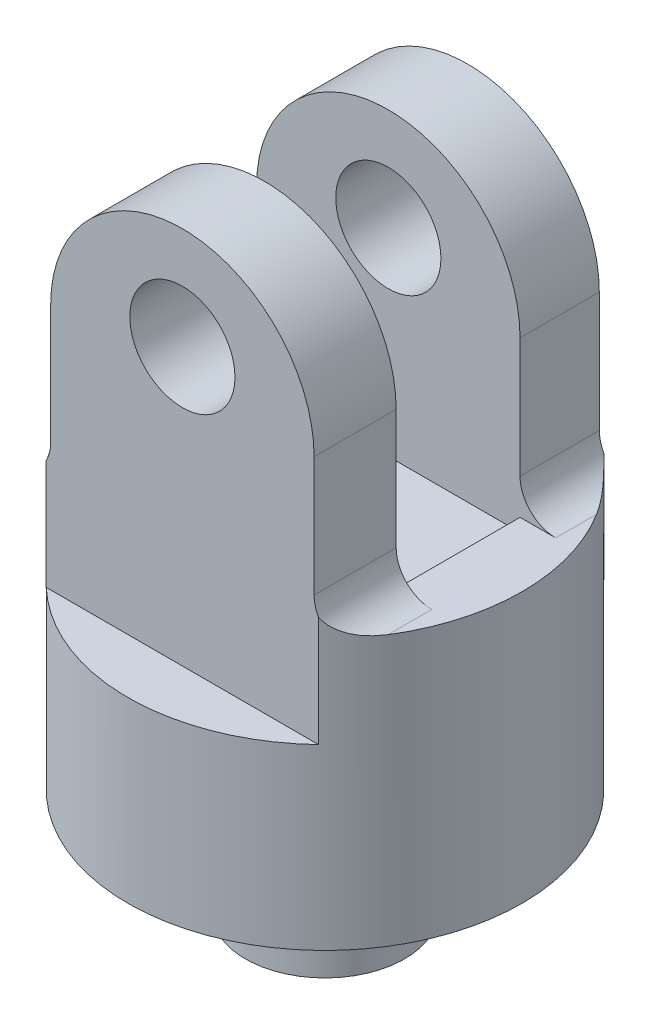
ISO-10303-21;
HEADER;
FILE_DESCRIPTION(('STEP AP214'),'2;1');
FILE_NAME('part.step','',(''),(''),'','','');
FILE_SCHEMA(('AUTOMOTIVE_DESIGN { 1 0 10303 214 1 1 1 1 }'));
ENDSEC;
DATA;
#1=APPLICATION_CONTEXT('core data for automotive mechanical design processes');
#2=APPLICATION_PROTOCOL_DEFINITION('international standard','automotive_design',2000,#1);
#3=PRODUCT_CONTEXT('',#1,'mechanical');
#4=PRODUCT('Part','Part','',(#3));
#5=PRODUCT_RELATED_PRODUCT_CATEGORY('part','',(#4));
#6=PRODUCT_DEFINITION_FORMATION('','',#4);
#7=PRODUCT_DEFINITION_CONTEXT('part definition',#1,'design');
#8=PRODUCT_DEFINITION('design','',#6,#7);
#9=PRODUCT_DEFINITION_SHAPE('','',#8);
#10=(LENGTH_UNIT() NAMED_UNIT(*) SI_UNIT(.MILLI.,.METRE.));
#11=(NAMED_UNIT(*) PLANE_ANGLE_UNIT() SI_UNIT($,.RADIAN.));
#12=(NAMED_UNIT(*) SI_UNIT($,.STERADIAN.) SOLID_ANGLE_UNIT());
#13=UNCERTAINTY_MEASURE_WITH_UNIT(LENGTH_MEASURE(1.E-05),#10,'distance_accuracy_value','');
#14=(GEOMETRIC_REPRESENTATION_CONTEXT(3) GLOBAL_UNCERTAINTY_ASSIGNED_CONTEXT((#13)) GLOBAL_UNIT_ASSIGNED_CONTEXT((#10,
#11,#12)) REPRESENTATION_CONTEXT('',''));
#15=CARTESIAN_POINT('',(0.,0.,0.));
#16=DIRECTION('',(0.,0.,1.));
#17=DIRECTION('',(1.,0.,0.));
#18=AXIS2_PLACEMENT_3D('',#15,#16,#17);
#19=CARTESIAN_POINT('',(-35.3357260875996,3.67124426884152,-80.));
#20=DIRECTION('',(-1.,0.,0.));
#21=DIRECTION('',(0.,0.,1.));
#22=AXIS2_PLACEMENT_3D('',#19,#20,#21);
#23=PLANE('',#22);
#24=DIRECTION('',(0.,-1.,0.));
#25=VECTOR('',#24,1.);
#26=CARTESIAN_POINT('',(-35.3357260875996,110.,-23.0221834509995));
#27=LINE('',#26,#25);
#28=CARTESIAN_POINT('',(-35.3357260875996,47.2672699613345,-23.0221834509995));
#29=VERTEX_POINT('',#28);
#30=CARTESIAN_POINT('',(-35.3357260875996,13.6712442688415,-23.0221834509995));
#31=VERTEX_POINT('',#30);
#32=EDGE_CURVE('E182',#29,#31,#27,.T.);
#33=ORIENTED_EDGE('',*,*,#32,.T.);
#34=DIRECTION('',(0.,0.,1.));
#35=VECTOR('',#34,1.);
#36=CARTESIAN_POINT('',(-35.3357260875996,13.6712442688415,0.));
#37=LINE('',#36,#35);
#38=CARTESIAN_POINT('',(-35.3357260875996,13.6712442688415,0.));
#39=VERTEX_POINT('',#38);
#40=EDGE_CURVE('E318',#31,#39,#37,.T.);
#41=ORIENTED_EDGE('',*,*,#40,.T.);
#42=DIRECTION('',(0.,-1.,0.));
#43=VECTOR('',#42,1.);
#44=CARTESIAN_POINT('',(-35.3357260875996,3.67124426884152,0.));
#45=LINE('',#44,#43);
#46=CARTESIAN_POINT('',(-35.3357260875996,47.2672699613345,0.));
#47=VERTEX_POINT('',#46);
#48=EDGE_CURVE('E261',#47,#39,#45,.T.);
#49=ORIENTED_EDGE('',*,*,#48,.F.);
#50=DIRECTION('',(0.,0.,1.));
#51=VECTOR('',#50,1.);
#52=CARTESIAN_POINT('',(-35.3357260875996,47.2672699613345,-80.));
#53=LINE('',#52,#51);
#54=EDGE_CURVE('E281',#29,#47,#53,.T.);
#55=ORIENTED_EDGE('',*,*,#54,.F.);
#56=EDGE_LOOP('',(#33,#41,#49,#55));
#57=FACE_BOUND('',#56,.T.);
#58=ADVANCED_FACE('F35',(#57),#23,.T.);
#59=DIRECTION('',(0.,-1.,0.));
#60=VECTOR('',#59,1.);
#61=CARTESIAN_POINT('',(-35.3357260875996,3.67124426884152,-80.));
#62=LINE('',#61,#60);
#63=CARTESIAN_POINT('',(-35.3357260875996,47.2672699613345,-80.));
#64=VERTEX_POINT('',#63);
#65=CARTESIAN_POINT('',(-35.3357260875996,13.6712442688415,-80.));
#66=VERTEX_POINT('',#65);
#67=EDGE_CURVE('E266',#64,#66,#62,.T.);
#68=ORIENTED_EDGE('',*,*,#67,.T.);
#69=DIRECTION('',(0.,0.,1.));
#70=VECTOR('',#69,1.);
#71=CARTESIAN_POINT('',(-35.3357260875996,13.6712442688415,-57.7614080820315));
#72=LINE('',#71,#70);
#73=CARTESIAN_POINT('',(-35.3357260875996,13.6712442688415,-57.7614080820315));
#74=VERTEX_POINT('',#73);
#75=EDGE_CURVE('E288',#66,#74,#72,.T.);
#76=ORIENTED_EDGE('',*,*,#75,.T.);
#77=DIRECTION('',(0.,-1.,0.));
#78=VECTOR('',#77,1.);
#79=CARTESIAN_POINT('',(-35.3357260875996,110.,-57.7614080820315));
#80=LINE('',#79,#78);
#81=CARTESIAN_POINT('',(-35.3357260875996,47.2672699613345,-57.7614080820315));
#82=VERTEX_POINT('',#81);
#83=EDGE_CURVE('E210',#82,#74,#80,.T.);
#84=ORIENTED_EDGE('',*,*,#83,.F.);
#85=EDGE_CURVE('E243',#64,#82,#53,.T.);
#86=ORIENTED_EDGE('',*,*,#85,.F.);
#87=EDGE_LOOP('',(#68,#76,#84,#86));
#88=FACE_BOUND('',#87,.T.);
#89=ADVANCED_FACE('F443',(#88),#23,.T.);
#90=CARTESIAN_POINT('',(1.60616936761816,47.2672699613345,-80.));
#91=DIRECTION('',(0.,0.,1.));
#92=DIRECTION('',(1.,0.,0.));
#93=AXIS2_PLACEMENT_3D('',#90,#91,#92);
#94=CYLINDRICAL_SURFACE('',#93,36.9418954552177);
#95=DIRECTION('',(0.,0.,1.));
#96=VECTOR('',#95,1.);
#97=CARTESIAN_POINT('',(38.5480648228359,47.2672699613345,-80.));
#98=LINE('',#97,#96);
#99=CARTESIAN_POINT('',(38.5480648228359,47.2672699613345,-23.0221834509995));
#100=VERTEX_POINT('',#99);
#101=CARTESIAN_POINT('',(38.5480648228359,47.2672699613345,0.));
#102=VERTEX_POINT('',#101);
#103=EDGE_CURVE('E285',#100,#102,#98,.T.);
#104=ORIENTED_EDGE('',*,*,#103,.F.);
#105=CARTESIAN_POINT('',(1.60616936761816,47.2672699613345,-23.0221834509995));
#106=DIRECTION('',(0.,0.,-1.));
#107=DIRECTION('',(-1.,0.,0.));
#108=AXIS2_PLACEMENT_3D('',#105,#106,#107);
#109=CIRCLE('',#108,36.9418954552177);
#110=EDGE_CURVE('E220',#100,#29,#109,.F.);
#111=ORIENTED_EDGE('',*,*,#110,.T.);
#112=ORIENTED_EDGE('',*,*,#54,.T.);
#113=CARTESIAN_POINT('',(1.60616936761816,47.2672699613345,0.));
#114=DIRECTION('',(0.,0.,1.));
#115=DIRECTION('',(-1.,0.,0.));
#116=AXIS2_PLACEMENT_3D('',#113,#114,#115);
#117=CIRCLE('',#116,36.9418954552177);
#118=EDGE_CURVE('E274',#102,#47,#117,.T.);
#119=ORIENTED_EDGE('',*,*,#118,.F.);
#120=EDGE_LOOP('',(#104,#111,#112,#119));
#121=FACE_BOUND('',#120,.T.);
#122=ADVANCED_FACE('F395',(#121),#94,.T.);
#123=ORIENTED_EDGE('',*,*,#85,.T.);
#124=CARTESIAN_POINT('',(1.60616936761816,47.2672699613345,-57.7614080820315));
#125=DIRECTION('',(0.,0.,1.));
#126=DIRECTION('',(1.,0.,0.));
#127=AXIS2_PLACEMENT_3D('',#124,#125,#126);
#128=CIRCLE('',#127,36.9418954552177);
#129=CARTESIAN_POINT('',(38.5480648228359,47.2672699613345,-57.7614080820315));
#130=VERTEX_POINT('',#129);
#131=EDGE_CURVE('E215',#82,#130,#128,.F.);
#132=ORIENTED_EDGE('',*,*,#131,.T.);
#133=CARTESIAN_POINT('',(38.5480648228359,47.2672699613345,-80.));
#134=VERTEX_POINT('',#133);
#135=EDGE_CURVE('E282',#134,#130,#98,.T.);
#136=ORIENTED_EDGE('',*,*,#135,.F.);
#137=CARTESIAN_POINT('',(1.60616936761816,47.2672699613345,-80.));
#138=DIRECTION('',(0.,0.,1.));
#139=DIRECTION('',(-1.,0.,0.));
#140=AXIS2_PLACEMENT_3D('',#137,#138,#139);
#141=CIRCLE('',#140,36.9418954552177);
#142=EDGE_CURVE('E263',#134,#64,#141,.T.);
#143=ORIENTED_EDGE('',*,*,#142,.T.);
#144=EDGE_LOOP('',(#123,#132,#136,#143));
#145=FACE_BOUND('',#144,.T.);
#146=ADVANCED_FACE('F452',(#145),#94,.T.);
#147=CARTESIAN_POINT('',(38.5480648228359,3.67124426884152,-80.));
#148=DIRECTION('',(1.,0.,0.));
#149=DIRECTION('',(0.,0.,-1.));
#150=AXIS2_PLACEMENT_3D('',#147,#148,#149);
#151=PLANE('',#150);
#152=DIRECTION('',(0.,1.,0.));
#153=VECTOR('',#152,1.);
#154=CARTESIAN_POINT('',(38.5480648228359,3.67124426884152,0.));
#155=LINE('',#154,#153);
#156=CARTESIAN_POINT('',(38.5480648228359,13.6712442688415,0.));
#157=VERTEX_POINT('',#156);
#158=EDGE_CURVE('E272',#157,#102,#155,.T.);
#159=ORIENTED_EDGE('',*,*,#158,.F.);
#160=DIRECTION('',(0.,0.,1.));
#161=VECTOR('',#160,1.);
#162=CARTESIAN_POINT('',(38.5480648228359,13.6712442688415,-23.0221834509995));
#163=LINE('',#162,#161);
#164=CARTESIAN_POINT('',(38.5480648228359,13.6712442688415,-23.0221834509995));
#165=VERTEX_POINT('',#164);
#166=EDGE_CURVE('E316',#157,#165,#163,.F.);
#167=ORIENTED_EDGE('',*,*,#166,.T.);
#168=DIRECTION('',(0.,-1.,0.));
#169=VECTOR('',#168,1.);
#170=CARTESIAN_POINT('',(38.5480648228359,110.,-23.0221834509995));
#171=LINE('',#170,#169);
#172=EDGE_CURVE('E183',#100,#165,#171,.T.);
#173=ORIENTED_EDGE('',*,*,#172,.F.);
#174=ORIENTED_EDGE('',*,*,#103,.T.);
#175=EDGE_LOOP('',(#159,#167,#173,#174));
#176=FACE_BOUND('',#175,.T.);
#177=ADVANCED_FACE('F401',(#176),#151,.T.);
#178=DIRECTION('',(0.,-1.,0.));
#179=VECTOR('',#178,1.);
#180=CARTESIAN_POINT('',(38.5480648228359,110.,-57.7614080820315));
#181=LINE('',#180,#179);
#182=CARTESIAN_POINT('',(38.5480648228359,13.6712442688415,-57.7614080820315));
#183=VERTEX_POINT('',#182);
#184=EDGE_CURVE('E213',#130,#183,#181,.T.);
#185=ORIENTED_EDGE('',*,*,#184,.T.);
#186=DIRECTION('',(0.,0.,1.));
#187=VECTOR('',#186,1.);
#188=CARTESIAN_POINT('',(38.5480648228359,13.6712442688415,-80.));
#189=LINE('',#188,#187);
#190=CARTESIAN_POINT('',(38.5480648228359,13.6712442688415,-80.));
#191=VERTEX_POINT('',#190);
#192=EDGE_CURVE('E314',#183,#191,#189,.F.);
#193=ORIENTED_EDGE('',*,*,#192,.T.);
#194=DIRECTION('',(0.,1.,0.));
#195=VECTOR('',#194,1.);
#196=CARTESIAN_POINT('',(38.5480648228359,3.67124426884152,-80.));
#197=LINE('',#196,#195);
#198=EDGE_CURVE('E260',#191,#134,#197,.T.);
#199=ORIENTED_EDGE('',*,*,#198,.T.);
#200=ORIENTED_EDGE('',*,*,#135,.T.);
#201=EDGE_LOOP('',(#185,#193,#199,#200));
#202=FACE_BOUND('',#201,.T.);
#203=ADVANCED_FACE('F454',(#202),#151,.T.);
#204=CARTESIAN_POINT('',(1.60616936761816,55.4784293733319,-80.));
#205=DIRECTION('',(0.,0.,1.));
#206=DIRECTION('',(1.,0.,0.));
#207=AXIS2_PLACEMENT_3D('',#204,#205,#206);
#208=CYLINDRICAL_SURFACE('',#207,14.7529801741657);
#209=CARTESIAN_POINT('',(1.60616936761816,55.4784293733319,0.));
#210=DIRECTION('',(0.,0.,1.));
#211=DIRECTION('',(1.,0.,0.));
#212=AXIS2_PLACEMENT_3D('',#209,#210,#211);
#213=CIRCLE('',#212,14.7529801741657);
#214=CARTESIAN_POINT('',(16.3591495417839,55.4784293733319,0.));
#215=VERTEX_POINT('',#214);
#216=EDGE_CURVE('E247',#215,#215,#213,.T.);
#217=ORIENTED_EDGE('',*,*,#216,.T.);
#218=EDGE_LOOP('',(#217));
#219=FACE_BOUND('',#218,.T.);
#220=CARTESIAN_POINT('',(1.60616936761816,55.4784293733319,-23.0221834509995));
#221=DIRECTION('',(0.,0.,-1.));
#222=DIRECTION('',(-1.,0.,0.));
#223=AXIS2_PLACEMENT_3D('',#220,#221,#222);
#224=CIRCLE('',#223,14.7529801741657);
#225=CARTESIAN_POINT('',(-13.1468108065476,55.4784293733319,-23.0221834509995));
#226=VERTEX_POINT('',#225);
#227=EDGE_CURVE('E218',#226,#226,#224,.F.);
#228=ORIENTED_EDGE('',*,*,#227,.F.);
#229=EDGE_LOOP('',(#228));
#230=FACE_BOUND('',#229,.T.);
#231=ADVANCED_FACE('F459',(#219,#230),#208,.F.);
#232=CARTESIAN_POINT('',(1.60616936761816,55.4784293733319,-80.));
#233=DIRECTION('',(0.,0.,1.));
#234=DIRECTION('',(1.,0.,0.));
#235=AXIS2_PLACEMENT_3D('',#232,#233,#234);
#236=CIRCLE('',#235,14.7529801741657);
#237=CARTESIAN_POINT('',(16.3591495417839,55.4784293733319,-80.));
#238=VERTEX_POINT('',#237);
#239=EDGE_CURVE('E251',#238,#238,#236,.T.);
#240=ORIENTED_EDGE('',*,*,#239,.F.);
#241=EDGE_LOOP('',(#240));
#242=FACE_BOUND('',#241,.T.);
#243=CARTESIAN_POINT('',(1.60616936761816,55.4784293733319,-57.7614080820315));
#244=DIRECTION('',(0.,0.,1.));
#245=DIRECTION('',(1.,0.,0.));
#246=AXIS2_PLACEMENT_3D('',#243,#244,#245);
#247=CIRCLE('',#246,14.7529801741657);
#248=CARTESIAN_POINT('',(16.3591495417839,55.4784293733319,-57.7614080820315));
#249=VERTEX_POINT('',#248);
#250=EDGE_CURVE('E219',#249,#249,#247,.F.);
#251=ORIENTED_EDGE('',*,*,#250,.F.);
#252=EDGE_LOOP('',(#251));
#253=FACE_BOUND('',#252,.T.);
#254=ADVANCED_FACE('F511',(#242,#253),#208,.F.);
#255=CARTESIAN_POINT('',(-53.6919474318071,3.67124426884152,-80.));
#256=DIRECTION('',(0.,1.,0.));
#257=DIRECTION('',(0.,0.,1.));
#258=AXIS2_PLACEMENT_3D('',#255,#256,#257);
#259=PLANE('',#258);
#260=DIRECTION('',(0.,0.,-1.));
#261=VECTOR('',#260,1.);
#262=CARTESIAN_POINT('',(-35.3357260875996,3.67124426884152,-80.));
#263=LINE('',#262,#261);
#264=CARTESIAN_POINT('',(-35.3357260875996,3.67124426884152,-23.0221834509995));
#265=VERTEX_POINT('',#264);
#266=CARTESIAN_POINT('',(-35.3357260875996,3.67124426884152,-57.7614080820315));
#267=VERTEX_POINT('',#266);
#268=EDGE_CURVE('E181',#265,#267,#263,.T.);
#269=ORIENTED_EDGE('',*,*,#268,.T.);
#270=DIRECTION('',(-1.,0.,0.));
#271=VECTOR('',#270,1.);
#272=CARTESIAN_POINT('',(-35.3357260875996,3.67124426884152,-57.7614080820315));
#273=LINE('',#272,#271);
#274=CARTESIAN_POINT('',(-45.3357260875996,3.67124426884152,-57.7614080820315));
#275=VERTEX_POINT('',#274);
#276=EDGE_CURVE('E302',#267,#275,#273,.T.);
#277=ORIENTED_EDGE('',*,*,#276,.T.);
#278=DIRECTION('',(0.,0.,1.));
#279=VECTOR('',#278,1.);
#280=CARTESIAN_POINT('',(-45.3357260875996,3.67124426884152,-80.));
#281=LINE('',#280,#279);
#282=CARTESIAN_POINT('',(-45.3357260875996,3.67124426884152,-69.2290980468836));
#283=VERTEX_POINT('',#282);
#284=EDGE_CURVE('E300',#275,#283,#281,.F.);
#285=ORIENTED_EDGE('',*,*,#284,.T.);
#286=CARTESIAN_POINT('',(1.60616936761921,3.67124426884152,-40.0000000000004));
#287=DIRECTION('',(0.,1.,0.));
#288=DIRECTION('',(0.,0.,1.));
#289=AXIS2_PLACEMENT_3D('',#286,#287,#288);
#290=CIRCLE('',#289,55.2981167994264);
#291=CARTESIAN_POINT('',(-45.3357260875996,3.67124426884152,-10.7709019531173));
#292=VERTEX_POINT('',#291);
#293=EDGE_CURVE('E233',#292,#283,#290,.F.);
#294=ORIENTED_EDGE('',*,*,#293,.F.);
#295=DIRECTION('',(0.,0.,1.));
#296=VECTOR('',#295,1.);
#297=CARTESIAN_POINT('',(-45.3357260875996,3.67124426884152,-23.0221834509995));
#298=LINE('',#297,#296);
#299=CARTESIAN_POINT('',(-45.3357260875996,3.67124426884152,-23.0221834509995));
#300=VERTEX_POINT('',#299);
#301=EDGE_CURVE('E297',#292,#300,#298,.F.);
#302=ORIENTED_EDGE('',*,*,#301,.T.);
#303=DIRECTION('',(1.,0.,0.));
#304=VECTOR('',#303,1.);
#305=CARTESIAN_POINT('',(-35.3357260875996,3.67124426884152,-23.0221834509995));
#306=LINE('',#305,#304);
#307=EDGE_CURVE('E295',#300,#265,#306,.T.);
#308=ORIENTED_EDGE('',*,*,#307,.T.);
#309=EDGE_LOOP('',(#269,#277,#285,#294,#302,#308));
#310=FACE_BOUND('',#309,.T.);
#311=ADVANCED_FACE('F384',(#310),#259,.T.);
#312=CARTESIAN_POINT('',(56.9042861670435,3.67124426884152,-80.));
#313=DIRECTION('',(0.,1.,0.));
#314=DIRECTION('',(-1.,0.,0.));
#315=AXIS2_PLACEMENT_3D('',#312,#313,#314);
#316=PLANE('',#315);
#317=CARTESIAN_POINT('',(1.60616936761731,3.67124426884152,-40.0000000000004));
#318=DIRECTION('',(0.,1.,0.));
#319=DIRECTION('',(-1.,0.,0.));
#320=AXIS2_PLACEMENT_3D('',#317,#318,#319);
#321=CIRCLE('',#320,55.2981167994262);
#322=CARTESIAN_POINT('',(48.5480648228359,3.67124426884152,-69.2290980468835));
#323=VERTEX_POINT('',#322);
#324=CARTESIAN_POINT('',(48.5480648228359,3.67124426884152,-10.7709019531173));
#325=VERTEX_POINT('',#324);
#326=EDGE_CURVE('E228',#323,#325,#321,.F.);
#327=ORIENTED_EDGE('',*,*,#326,.F.);
#328=DIRECTION('',(0.,0.,1.));
#329=VECTOR('',#328,1.);
#330=CARTESIAN_POINT('',(48.5480648228359,3.67124426884152,-57.7614080820315));
#331=LINE('',#330,#329);
#332=CARTESIAN_POINT('',(48.5480648228359,3.67124426884152,-57.7614080820315));
#333=VERTEX_POINT('',#332);
#334=EDGE_CURVE('E311',#323,#333,#331,.T.);
#335=ORIENTED_EDGE('',*,*,#334,.T.);
#336=DIRECTION('',(-1.,0.,0.));
#337=VECTOR('',#336,1.);
#338=CARTESIAN_POINT('',(-35.3357260875996,3.67124426884152,-57.7614080820315));
#339=LINE('',#338,#337);
#340=CARTESIAN_POINT('',(38.5480648228359,3.67124426884152,-57.7614080820315));
#341=VERTEX_POINT('',#340);
#342=EDGE_CURVE('E309',#333,#341,#339,.T.);
#343=ORIENTED_EDGE('',*,*,#342,.T.);
#344=DIRECTION('',(0.,0.,1.));
#345=VECTOR('',#344,1.);
#346=CARTESIAN_POINT('',(38.5480648228359,3.67124426884152,-80.));
#347=LINE('',#346,#345);
#348=CARTESIAN_POINT('',(38.5480648228359,3.67124426884152,-23.0221834509995));
#349=VERTEX_POINT('',#348);
#350=EDGE_CURVE('E269',#341,#349,#347,.T.);
#351=ORIENTED_EDGE('',*,*,#350,.T.);
#352=DIRECTION('',(1.,0.,0.));
#353=VECTOR('',#352,1.);
#354=CARTESIAN_POINT('',(-35.3357260875996,3.67124426884152,-23.0221834509995));
#355=LINE('',#354,#353);
#356=CARTESIAN_POINT('',(48.5480648228359,3.67124426884152,-23.0221834509995));
#357=VERTEX_POINT('',#356);
#358=EDGE_CURVE('E60',#349,#357,#355,.T.);
#359=ORIENTED_EDGE('',*,*,#358,.T.);
#360=DIRECTION('',(0.,0.,1.));
#361=VECTOR('',#360,1.);
#362=CARTESIAN_POINT('',(48.5480648228359,3.67124426884152,0.));
#363=LINE('',#362,#361);
#364=EDGE_CURVE('E306',#357,#325,#363,.T.);
#365=ORIENTED_EDGE('',*,*,#364,.T.);
#366=EDGE_LOOP('',(#327,#335,#343,#351,#359,#365));
#367=FACE_BOUND('',#366,.T.);
#368=ADVANCED_FACE('F345',(#367),#316,.T.);
#369=CARTESIAN_POINT('',(1.60616936761816,47.2672699613345,-80.));
#370=DIRECTION('',(0.,0.,-1.));
#371=DIRECTION('',(-1.,0.,0.));
#372=AXIS2_PLACEMENT_3D('',#369,#370,#371);
#373=PLANE('',#372);
#374=DIRECTION('',(0.,-1.,0.));
#375=VECTOR('',#374,1.);
#376=CARTESIAN_POINT('',(39.7883867150023,7.97253438695091,-80.));
#377=LINE('',#376,#375);
#378=CARTESIAN_POINT('',(39.7883867150023,8.84754864752161,-80.));
#379=VERTEX_POINT('',#378);
#380=CARTESIAN_POINT('',(39.7883867150023,-22.0274656130491,-80.));
#381=VERTEX_POINT('',#380);
#382=EDGE_CURVE('E224',#379,#381,#377,.T.);
#383=ORIENTED_EDGE('',*,*,#382,.T.);
#384=DIRECTION('',(1.,0.,0.));
#385=VECTOR('',#384,1.);
#386=CARTESIAN_POINT('',(56.9042861670435,-22.0274656130491,-80.));
#387=LINE('',#386,#385);
#388=CARTESIAN_POINT('',(-36.576047979766,-22.0274656130491,-80.));
#389=VERTEX_POINT('',#388);
#390=EDGE_CURVE('E257',#389,#381,#387,.T.);
#391=ORIENTED_EDGE('',*,*,#390,.F.);
#392=DIRECTION('',(0.,-1.,0.));
#393=VECTOR('',#392,1.);
#394=CARTESIAN_POINT('',(-36.576047979766,7.97253438695091,-80.));
#395=LINE('',#394,#393);
#396=CARTESIAN_POINT('',(-36.576047979766,8.84754864752157,-80.));
#397=VERTEX_POINT('',#396);
#398=EDGE_CURVE('E231',#397,#389,#395,.T.);
#399=ORIENTED_EDGE('',*,*,#398,.F.);
#400=CARTESIAN_POINT('',(-45.3357260875996,13.6712442688415,-80.));
#401=DIRECTION('',(0.,0.,-1.));
#402=DIRECTION('',(-1.,0.,0.));
#403=AXIS2_PLACEMENT_3D('',#400,#401,#402);
#404=CIRCLE('',#403,10.);
#405=EDGE_CURVE('E332',#397,#66,#404,.F.);
#406=ORIENTED_EDGE('',*,*,#405,.T.);
#407=ORIENTED_EDGE('',*,*,#67,.F.);
#408=ORIENTED_EDGE('',*,*,#142,.F.);
#409=ORIENTED_EDGE('',*,*,#198,.F.);
#410=CARTESIAN_POINT('',(48.5480648228359,13.6712442688415,-80.));
#411=DIRECTION('',(0.,0.,-1.));
#412=DIRECTION('',(-1.,0.,0.));
#413=AXIS2_PLACEMENT_3D('',#410,#411,#412);
#414=CIRCLE('',#413,10.);
#415=EDGE_CURVE('E361',#191,#379,#414,.F.);
#416=ORIENTED_EDGE('',*,*,#415,.T.);
#417=EDGE_LOOP('',(#383,#391,#399,#406,#407,#408,#409,#416));
#418=FACE_BOUND('',#417,.T.);
#419=ORIENTED_EDGE('',*,*,#239,.T.);
#420=EDGE_LOOP('',(#419));
#421=FACE_BOUND('',#420,.T.);
#422=ADVANCED_FACE('F422',(#418,#421),#373,.T.);
#423=CARTESIAN_POINT('',(1.60616936761816,47.2672699613345,0.));
#424=DIRECTION('',(0.,0.,-1.));
#425=DIRECTION('',(-1.,0.,0.));
#426=AXIS2_PLACEMENT_3D('',#423,#424,#425);
#427=PLANE('',#426);
#428=ORIENTED_EDGE('',*,*,#216,.F.);
#429=EDGE_LOOP('',(#428));
#430=FACE_BOUND('',#429,.T.);
#431=DIRECTION('',(1.,0.,0.));
#432=VECTOR('',#431,1.);
#433=CARTESIAN_POINT('',(56.9042861670435,-22.0274656130491,0.));
#434=LINE('',#433,#432);
#435=CARTESIAN_POINT('',(-36.576047979766,-22.0274656130491,0.));
#436=VERTEX_POINT('',#435);
#437=CARTESIAN_POINT('',(39.7883867150023,-22.0274656130491,0.));
#438=VERTEX_POINT('',#437);
#439=EDGE_CURVE('E254',#436,#438,#434,.T.);
#440=ORIENTED_EDGE('',*,*,#439,.T.);
#441=DIRECTION('',(0.,-1.,0.));
#442=VECTOR('',#441,1.);
#443=CARTESIAN_POINT('',(39.7883867150023,7.97253438695091,0.));
#444=LINE('',#443,#442);
#445=CARTESIAN_POINT('',(39.7883867150023,8.84754864752161,0.));
#446=VERTEX_POINT('',#445);
#447=EDGE_CURVE('E226',#446,#438,#444,.T.);
#448=ORIENTED_EDGE('',*,*,#447,.F.);
#449=CARTESIAN_POINT('',(48.5480648228359,13.6712442688415,0.));
#450=DIRECTION('',(0.,0.,-1.));
#451=DIRECTION('',(-1.,0.,0.));
#452=AXIS2_PLACEMENT_3D('',#449,#450,#451);
#453=CIRCLE('',#452,10.);
#454=EDGE_CURVE('E368',#446,#157,#453,.T.);
#455=ORIENTED_EDGE('',*,*,#454,.T.);
#456=ORIENTED_EDGE('',*,*,#158,.T.);
#457=ORIENTED_EDGE('',*,*,#118,.T.);
#458=ORIENTED_EDGE('',*,*,#48,.T.);
#459=CARTESIAN_POINT('',(-45.3357260875996,13.6712442688415,0.));
#460=DIRECTION('',(0.,0.,-1.));
#461=DIRECTION('',(-1.,0.,0.));
#462=AXIS2_PLACEMENT_3D('',#459,#460,#461);
#463=CIRCLE('',#462,10.);
#464=CARTESIAN_POINT('',(-36.576047979766,8.84754864752157,0.));
#465=VERTEX_POINT('',#464);
#466=EDGE_CURVE('E372',#39,#465,#463,.T.);
#467=ORIENTED_EDGE('',*,*,#466,.T.);
#468=DIRECTION('',(0.,-1.,0.));
#469=VECTOR('',#468,1.);
#470=CARTESIAN_POINT('',(-36.576047979766,7.97253438695091,0.));
#471=LINE('',#470,#469);
#472=EDGE_CURVE('E52',#465,#436,#471,.T.);
#473=ORIENTED_EDGE('',*,*,#472,.T.);
#474=EDGE_LOOP('',(#440,#448,#455,#456,#457,#458,#467,#473));
#475=FACE_BOUND('',#474,.T.);
#476=ADVANCED_FACE('F428',(#430,#475),#427,.F.);
#477=CARTESIAN_POINT('',(1.60616936761815,-22.0274656130491,-40.));
#478=DIRECTION('',(0.,-1.,0.));
#479=DIRECTION('',(0.,0.,-1.));
#480=AXIS2_PLACEMENT_3D('',#477,#478,#479);
#481=PLANE('',#480);
#482=CARTESIAN_POINT('',(1.60616936761815,-22.0274656130491,-40.));
#483=DIRECTION('',(0.,-1.,0.));
#484=DIRECTION('',(0.,0.,-1.));
#485=AXIS2_PLACEMENT_3D('',#482,#483,#484);
#486=CIRCLE('',#485,55.2981167994253);
#487=EDGE_CURVE('E239',#389,#381,#486,.T.);
#488=ORIENTED_EDGE('',*,*,#487,.F.);
#489=ORIENTED_EDGE('',*,*,#390,.T.);
#490=EDGE_LOOP('',(#488,#489));
#491=FACE_BOUND('',#490,.T.);
#492=ADVANCED_FACE('F426',(#491),#481,.F.);
#493=CARTESIAN_POINT('',(1.60616936761815,-72.0274656130491,-40.));
#494=DIRECTION('',(0.,1.,0.));
#495=DIRECTION('',(0.,0.,1.));
#496=AXIS2_PLACEMENT_3D('',#493,#494,#495);
#497=CYLINDRICAL_SURFACE('',#496,55.2981167994253);
#498=CARTESIAN_POINT('',(1.60616936761815,-72.0274656130491,-40.));
#499=DIRECTION('',(0.,-1.,0.));
#500=DIRECTION('',(0.,0.,-1.));
#501=AXIS2_PLACEMENT_3D('',#498,#499,#500);
#502=CIRCLE('',#501,55.2981167994253);
#503=CARTESIAN_POINT('',(1.60616936761815,-72.0274656130491,-95.2981167994253));
#504=VERTEX_POINT('',#503);
#505=EDGE_CURVE('E244',#504,#504,#502,.T.);
#506=ORIENTED_EDGE('',*,*,#505,.F.);
#507=EDGE_LOOP('',(#506));
#508=FACE_BOUND('',#507,.T.);
#509=ORIENTED_EDGE('',*,*,#487,.T.);
#510=ORIENTED_EDGE('',*,*,#382,.F.);
#511=CARTESIAN_POINT('',(39.7883867150023,8.84754864752161,-80.));
#512=CARTESIAN_POINT('',(39.9281871188496,8.59362709418037,-79.8665752157576));
#513=CARTESIAN_POINT('',(40.0767486447742,8.35000779778759,-79.7233449134136));
#514=CARTESIAN_POINT('',(40.387906979882,7.88419226749062,-79.419604384938));
#515=CARTESIAN_POINT('',(40.5504764747048,7.66195605340083,-79.2591276432534));
#516=CARTESIAN_POINT('',(40.8841221687268,7.24202526775361,-78.9253014383642));
#517=CARTESIAN_POINT('',(41.0550279846907,7.04400438169155,-78.7521893611469));
#518=CARTESIAN_POINT('',(41.4050443594755,6.66815669506541,-78.3926329157654));
#519=CARTESIAN_POINT('',(41.5841596523238,6.49034175728695,-78.2061808193607));
#520=CARTESIAN_POINT('',(42.0030463067224,6.10377202806529,-77.7636414331641));
#521=CARTESIAN_POINT('',(42.244833268584,5.90183689020937,-77.5034992106659));
#522=CARTESIAN_POINT('',(42.7338918460557,5.52938182225767,-76.9665279463139));
#523=CARTESIAN_POINT('',(42.9811645651996,5.35886827843045,-76.6896955274085));
#524=CARTESIAN_POINT('',(43.4805490805936,5.04522579177313,-76.1187413510829));
#525=CARTESIAN_POINT('',(43.7326840475888,4.90242534646951,-75.8244605365708));
#526=CARTESIAN_POINT('',(44.2362552299776,4.64415366164063,-75.2237312120097));
#527=CARTESIAN_POINT('',(44.4876914891106,4.52868067150179,-74.9172834828502));
#528=CARTESIAN_POINT('',(45.0775289122731,4.28558997200365,-74.1821166566602));
#529=CARTESIAN_POINT('',(45.414762266666,4.16848161271824,-73.7489795156556));
#530=CARTESIAN_POINT('',(46.080362150511,3.9743001420162,-72.8669092736657));
#531=CARTESIAN_POINT('',(46.4087215569165,3.89725833683569,-72.4179641125349));
#532=CARTESIAN_POINT('',(47.0465685305158,3.77941362114397,-71.5174468326044));
#533=CARTESIAN_POINT('',(47.3563135507656,3.73784166316359,-71.0661560210453));
#534=CARTESIAN_POINT('',(47.8109868849836,3.69728846112459,-70.3820907805755));
#535=CARTESIAN_POINT('',(47.9607566716128,3.68740396678863,-70.153090627889));
#536=CARTESIAN_POINT('',(48.2569464334456,3.67438471278801,-69.6927871306577));
#537=CARTESIAN_POINT('',(48.4033668745895,3.67124900855372,-69.4614841129783));
#538=CARTESIAN_POINT('',(48.5480648228357,3.67124426884152,-69.2290980468833));
#539=B_SPLINE_CURVE_WITH_KNOTS('',3,(#511,#512,#513,#514,#515,#516,#517,#518,#519,#520,#521,
#522,#523,#524,#525,#526,#527,#528,#529,#530,#531,#532,#533,#534,#535,#536,#537,#538),
.UNSPECIFIED.,.F.,.F.,(4,2,2,2,2,2,2,2,2,2,2,2,2,4),(0.,0.956479971877758,1.91113535943198,
2.85103081602461,3.7914752591542,5.01526933110279,6.23931185888591,7.47707938312097,
8.71476759373077,10.3965589539303,12.0796624247688,13.7252720797165,14.5465965480127,
15.3678060551685),.UNSPECIFIED.);
#540=EDGE_CURVE('E353',#379,#323,#539,.T.);
#541=ORIENTED_EDGE('',*,*,#540,.T.);
#542=ORIENTED_EDGE('',*,*,#326,.T.);
#543=CARTESIAN_POINT('',(48.5480648228359,3.67124426884152,-10.7709019531173));
#544=CARTESIAN_POINT('',(48.3622025988597,3.67125892162488,-10.4723957597336));
#545=CARTESIAN_POINT('',(48.1734636691323,3.67642754696652,-10.1756382539233));
#546=CARTESIAN_POINT('',(47.7904964965946,3.69813189585432,-9.58597192563651));
#547=CARTESIAN_POINT('',(47.5962664226466,3.71467145519314,-9.29306443588816));
#548=CARTESIAN_POINT('',(47.2015961935237,3.76030667835461,-8.71001059173708));
#549=CARTESIAN_POINT('',(47.0011271729082,3.78947269086543,-8.4198891560377));
#550=CARTESIAN_POINT('',(46.5955174801462,3.86155564737933,-7.84468796146749));
#551=CARTESIAN_POINT('',(46.3903772573598,3.90447127384535,-7.55960772229196));
#552=CARTESIAN_POINT('',(45.9704234641968,4.00668450186318,-6.98751839363588));
#553=CARTESIAN_POINT('',(45.7554981249827,4.06639175219501,-6.70066373150773));
#554=CARTESIAN_POINT('',(45.3221747740625,4.2031269488284,-6.13379496539856));
#555=CARTESIAN_POINT('',(45.1037770794579,4.28015332186421,-5.8537802426386));
#556=CARTESIAN_POINT('',(44.6650608897488,4.45290757863424,-5.30219803191112));
#557=CARTESIAN_POINT('',(44.4447479957586,4.54859185948946,-5.03061252825772));
#558=CARTESIAN_POINT('',(44.0031145056963,4.76038688638763,-4.49646803042643));
#559=CARTESIAN_POINT('',(43.7817942512069,4.87649114758686,-4.23390620211953));
#560=CARTESIAN_POINT('',(43.3541689235598,5.12254445398755,-3.73587352410921));
#561=CARTESIAN_POINT('',(43.1478239418288,5.25110094565808,-3.49975159728862));
#562=CARTESIAN_POINT('',(42.7373750560537,5.52892901818955,-3.03784262775589));
#563=CARTESIAN_POINT('',(42.5332714102674,5.67820295974476,-2.81205676671346));
#564=CARTESIAN_POINT('',(42.1315097913617,5.99707195236082,-2.37466559040375));
#565=CARTESIAN_POINT('',(41.9338072001808,6.16644309556041,-2.16293867338165));
#566=CARTESIAN_POINT('',(41.5451661964619,6.52773305760218,-1.75293521334195));
#567=CARTESIAN_POINT('',(41.3542258598489,6.71964539457817,-1.55465482943009));
#568=CARTESIAN_POINT('',(41.0419673695013,7.06114142782586,-1.2349095793583));
#569=CARTESIAN_POINT('',(40.9180313698333,7.20445207824963,-1.10927151843913));
#570=CARTESIAN_POINT('',(40.6756369659429,7.50183080499951,-0.865770575029773));
#571=CARTESIAN_POINT('',(40.5571767689427,7.65589531844768,-0.747905142311763));
#572=CARTESIAN_POINT('',(40.3256068422288,7.97645171393219,-0.519453079824522));
#573=CARTESIAN_POINT('',(40.2125649207211,8.14305540861722,-0.408954089218182));
#574=CARTESIAN_POINT('',(39.9942838066975,8.48718825758133,-0.197265817199698));
#575=CARTESIAN_POINT('',(39.8890514096893,8.66472668660428,-0.0960846257097341));
#576=CARTESIAN_POINT('',(39.7883867150023,8.84754864752161,0.));
#577=B_SPLINE_CURVE_WITH_KNOTS('',3,(#543,#544,#545,#546,#547,#548,#549,#550,#551,#552,#553,
#554,#555,#556,#557,#558,#559,#560,#561,#562,#563,#564,#565,#566,#567,#568,#569,#570,#571,#572,
#573,#574,#575,#576),.UNSPECIFIED.,.F.,.F.,(4,2,2,2,2,2,2,2,2,2,2,2,2,2,2,2,4),(0.,
1.05492004782086,2.11019612983517,3.17142894915398,4.23256010775694,5.32223779270642,
6.41181653150863,7.49887883689967,8.58559654146909,9.60159867957245,10.6177166834136,
11.623422372321,12.6288395688184,13.3104551588615,13.991845984037,14.6802665849361,
15.3692793614143),.UNSPECIFIED.);
#578=EDGE_CURVE('E360',#325,#446,#577,.T.);
#579=ORIENTED_EDGE('',*,*,#578,.T.);
#580=ORIENTED_EDGE('',*,*,#447,.T.);
#581=EDGE_CURVE('E248',#438,#436,#486,.T.);
#582=ORIENTED_EDGE('',*,*,#581,.T.);
#583=ORIENTED_EDGE('',*,*,#472,.F.);
#584=CARTESIAN_POINT('',(-36.576047979766,8.84754864752157,0.));
#585=CARTESIAN_POINT('',(-36.7158483836133,8.59362709418033,-0.133424784242399));
#586=CARTESIAN_POINT('',(-36.8644099095379,8.35000779778755,-0.27665508658637));
#587=CARTESIAN_POINT('',(-37.1755682446457,7.88419226749058,-0.580395615062045));
#588=CARTESIAN_POINT('',(-37.3381377394685,7.66195605340079,-0.740872356746655));
#589=CARTESIAN_POINT('',(-37.6717834334905,7.24202526775357,-1.07469856163585));
#590=CARTESIAN_POINT('',(-37.8426892494545,7.04400438169151,-1.24781063885312));
#591=CARTESIAN_POINT('',(-38.1927056242393,6.66815669506537,-1.60736708423456));
#592=CARTESIAN_POINT('',(-38.3718209170875,6.49034175728691,-1.79381918063935));
#593=CARTESIAN_POINT('',(-38.7907075714862,6.10377202806524,-2.23635856683596));
#594=CARTESIAN_POINT('',(-39.0324945333477,5.90183689020933,-2.49650078933412));
#595=CARTESIAN_POINT('',(-39.5215531108194,5.52938182225763,-3.03347205368614));
#596=CARTESIAN_POINT('',(-39.7688258299633,5.35886827843041,-3.3103044725915));
#597=CARTESIAN_POINT('',(-40.2682103453573,5.04522579177309,-3.88125864891713));
#598=CARTESIAN_POINT('',(-40.5203453123525,4.90242534646948,-4.17553946342927));
#599=CARTESIAN_POINT('',(-41.0239164947414,4.6441536616406,-4.77626878799039));
#600=CARTESIAN_POINT('',(-41.2753527538743,4.52868067150176,-5.08271651714988));
#601=CARTESIAN_POINT('',(-41.8651901770368,4.28558997200361,-5.81788334333988));
#602=CARTESIAN_POINT('',(-42.2024235314298,4.1684816127182,-6.25102048434454));
#603=CARTESIAN_POINT('',(-42.8680234152748,3.97430014201616,-7.13309072633449));
#604=CARTESIAN_POINT('',(-43.1963828216804,3.89725833683565,-7.58203588746534));
#605=CARTESIAN_POINT('',(-43.8342297952797,3.77941362114393,-8.48255316739582));
#606=CARTESIAN_POINT('',(-44.1439748155295,3.73784166316356,-8.93384397895496));
#607=CARTESIAN_POINT('',(-44.5986481497476,3.69728846112456,-9.61790921942485));
#608=CARTESIAN_POINT('',(-44.7484179363767,3.68740396678861,-9.8469093721114));
#609=CARTESIAN_POINT('',(-45.0446076982096,3.674384712788,-10.3072128693427));
#610=CARTESIAN_POINT('',(-45.1910281393535,3.67124900855371,-10.5385158870222));
#611=CARTESIAN_POINT('',(-45.3357260875996,3.67124426884152,-10.7709019531172));
#612=B_SPLINE_CURVE_WITH_KNOTS('',3,(#584,#585,#586,#587,#588,#589,#590,#591,#592,#593,#594,
#595,#596,#597,#598,#599,#600,#601,#602,#603,#604,#605,#606,#607,#608,#609,#610,#611),
.UNSPECIFIED.,.F.,.F.,(4,2,2,2,2,2,2,2,2,2,2,2,2,4),(0.,0.956479971877755,1.91113535943197,
2.85103081602461,3.79147525915422,5.01526933110281,6.23931185888594,7.477079383121,
8.71476759373082,10.3965589539304,12.0796624247691,13.7252720797169,14.5465965480132,
15.367806055169),.UNSPECIFIED.);
#613=EDGE_CURVE('E45',#465,#292,#612,.T.);
#614=ORIENTED_EDGE('',*,*,#613,.T.);
#615=ORIENTED_EDGE('',*,*,#293,.T.);
#616=CARTESIAN_POINT('',(-45.3357260875996,3.67124426884152,-69.2290980468836));
#617=CARTESIAN_POINT('',(-45.1498638636232,3.67125892162488,-69.5276042402671));
#618=CARTESIAN_POINT('',(-44.9611249338957,3.67642754696653,-69.8243617460773));
#619=CARTESIAN_POINT('',(-44.578157761358,3.69813189585434,-70.4140280743639));
#620=CARTESIAN_POINT('',(-44.38392768741,3.71467145519316,-70.7069355641122));
#621=CARTESIAN_POINT('',(-43.9892574582872,3.76030667835463,-71.2899894082632));
#622=CARTESIAN_POINT('',(-43.7887884376717,3.78947269086545,-71.5801108439625));
#623=CARTESIAN_POINT('',(-43.3831787449098,3.86155564737935,-72.1553120385326));
#624=CARTESIAN_POINT('',(-43.1780385221235,3.90447127384536,-72.4403922777081));
#625=CARTESIAN_POINT('',(-42.7580847289605,4.00668450186317,-73.0124816063641));
#626=CARTESIAN_POINT('',(-42.5431593897465,4.06639175219499,-73.2993362684922));
#627=CARTESIAN_POINT('',(-42.1098360388263,4.20312694882835,-73.8662050346013));
#628=CARTESIAN_POINT('',(-41.8914383442217,4.28015332186415,-74.1462197573612));
#629=CARTESIAN_POINT('',(-41.4527221545128,4.45290757863413,-74.6978019680886));
#630=CARTESIAN_POINT('',(-41.2324092605226,4.54859185948933,-74.969387471742));
#631=CARTESIAN_POINT('',(-40.7907757704603,4.76038688638744,-75.5035319695732));
#632=CARTESIAN_POINT('',(-40.569455515971,4.87649114758664,-75.76609379788));
#633=CARTESIAN_POINT('',(-40.1418301883239,5.12254445398729,-76.2641264758903));
#634=CARTESIAN_POINT('',(-39.9354852065929,5.2511009456578,-76.5002484027109));
#635=CARTESIAN_POINT('',(-39.5250363208178,5.52892901818926,-76.9621573722437));
#636=CARTESIAN_POINT('',(-39.3209326750315,5.67820295974445,-77.1879432332861));
#637=CARTESIAN_POINT('',(-38.9191710561257,5.99707195236049,-77.6253344095959));
#638=CARTESIAN_POINT('',(-38.7214684649448,6.16644309556007,-77.837061326618));
#639=CARTESIAN_POINT('',(-38.3328274612259,6.52773305760183,-78.2470647866577));
#640=CARTESIAN_POINT('',(-38.1418871246129,6.71964539457781,-78.4453451705696));
#641=CARTESIAN_POINT('',(-37.8296286342653,7.06114142782551,-78.7650904206414));
#642=CARTESIAN_POINT('',(-37.7056926345973,7.20445207824931,-78.8907284815606));
#643=CARTESIAN_POINT('',(-37.4632982307068,7.50183080499923,-79.13422942497));
#644=CARTESIAN_POINT('',(-37.3448380337065,7.65589531844742,-79.2520948576881));
#645=CARTESIAN_POINT('',(-37.1132681069926,7.97645171393198,-79.4805469201754));
#646=CARTESIAN_POINT('',(-37.0002261854849,8.14305540861704,-79.5910459107817));
#647=CARTESIAN_POINT('',(-36.7819450714612,8.48718825758121,-79.8027341828003));
#648=CARTESIAN_POINT('',(-36.676712674453,8.66472668660419,-79.9039153742902));
#649=CARTESIAN_POINT('',(-36.576047979766,8.84754864752157,-80.));
#650=B_SPLINE_CURVE_WITH_KNOTS('',3,(#616,#617,#618,#619,#620,#621,#622,#623,#624,#625,#626,
#627,#628,#629,#630,#631,#632,#633,#634,#635,#636,#637,#638,#639,#640,#641,#642,#643,#644,#645,
#646,#647,#648,#649),.UNSPECIFIED.,.F.,.F.,(4,2,2,2,2,2,2,2,2,2,2,2,2,2,2,2,4),(0.,
1.05492004782068,2.1101961298348,3.17142894915345,4.23256010775623,5.32223779270551,
6.41181653150756,7.49887883689841,8.58559654146765,9.60159867957104,10.6177166834122,
11.6234223723196,12.6288395688171,13.3104551588603,13.9918459840359,14.6802665849352,
15.3692793614135),.UNSPECIFIED.);
#651=EDGE_CURVE('E323',#283,#397,#650,.T.);
#652=ORIENTED_EDGE('',*,*,#651,.T.);
#653=ORIENTED_EDGE('',*,*,#398,.T.);
#654=EDGE_LOOP('',(#509,#510,#541,#542,#579,#580,#582,#583,#614,#615,#652,#653));
#655=FACE_BOUND('',#654,.T.);
#656=ADVANCED_FACE('F334',(#508,#655),#497,.T.);
#657=CARTESIAN_POINT('',(1.60616936761815,-72.0274656130491,-40.));
#658=DIRECTION('',(0.,-1.,0.));
#659=DIRECTION('',(0.,0.,-1.));
#660=AXIS2_PLACEMENT_3D('',#657,#658,#659);
#661=PLANE('',#660);
#662=CARTESIAN_POINT('',(1.60616936761815,-72.0274656130491,-40.));
#663=DIRECTION('',(0.,-1.,0.));
#664=DIRECTION('',(0.,0.,-1.));
#665=AXIS2_PLACEMENT_3D('',#662,#663,#664);
#666=CIRCLE('',#665,22.3258660048483);
#667=CARTESIAN_POINT('',(1.60616936761815,-72.0274656130491,-62.3258660048483));
#668=VERTEX_POINT('',#667);
#669=EDGE_CURVE('E240',#668,#668,#666,.T.);
#670=ORIENTED_EDGE('',*,*,#669,.F.);
#671=EDGE_LOOP('',(#670));
#672=FACE_BOUND('',#671,.T.);
#673=ORIENTED_EDGE('',*,*,#505,.T.);
#674=EDGE_LOOP('',(#673));
#675=FACE_BOUND('',#674,.T.);
#676=ADVANCED_FACE('F434',(#672,#675),#661,.T.);
#677=ORIENTED_EDGE('',*,*,#439,.F.);
#678=ORIENTED_EDGE('',*,*,#581,.F.);
#679=EDGE_LOOP('',(#677,#678));
#680=FACE_BOUND('',#679,.T.);
#681=ADVANCED_FACE('F429',(#680),#481,.F.);
#682=CARTESIAN_POINT('',(1.60616936761815,-102.027465613049,-40.));
#683=DIRECTION('',(0.,1.,0.));
#684=DIRECTION('',(0.,0.,1.));
#685=AXIS2_PLACEMENT_3D('',#682,#683,#684);
#686=CYLINDRICAL_SURFACE('',#685,22.3258660048483);
#687=CARTESIAN_POINT('',(1.60616936761815,-102.027465613049,-40.));
#688=DIRECTION('',(0.,-1.,0.));
#689=DIRECTION('',(0.,0.,-1.));
#690=AXIS2_PLACEMENT_3D('',#687,#688,#689);
#691=CIRCLE('',#690,22.3258660048483);
#692=CARTESIAN_POINT('',(1.60616936761815,-102.027465613049,-62.3258660048483));
#693=VERTEX_POINT('',#692);
#694=EDGE_CURVE('E236',#693,#693,#691,.T.);
#695=ORIENTED_EDGE('',*,*,#694,.F.);
#696=EDGE_LOOP('',(#695));
#697=FACE_BOUND('',#696,.T.);
#698=ORIENTED_EDGE('',*,*,#669,.T.);
#699=EDGE_LOOP('',(#698));
#700=FACE_BOUND('',#699,.T.);
#701=ADVANCED_FACE('F440',(#697,#700),#686,.T.);
#702=CARTESIAN_POINT('',(1.60616936761815,-102.027465613049,-40.));
#703=DIRECTION('',(0.,-1.,0.));
#704=DIRECTION('',(0.,0.,-1.));
#705=AXIS2_PLACEMENT_3D('',#702,#703,#704);
#706=PLANE('',#705);
#707=CARTESIAN_POINT('',(1.60616936761634,-102.027465613049,-40.));
#708=DIRECTION('',(0.,-1.,0.));
#709=DIRECTION('',(0.,0.,-1.));
#710=AXIS2_PLACEMENT_3D('',#707,#708,#709);
#711=CIRCLE('',#710,9.50772078129153);
#712=CARTESIAN_POINT('',(1.60616936761634,-102.027465613049,-49.5077207812915));
#713=VERTEX_POINT('',#712);
#714=EDGE_CURVE('E203',#713,#713,#711,.T.);
#715=ORIENTED_EDGE('',*,*,#714,.F.);
#716=EDGE_LOOP('',(#715));
#717=FACE_BOUND('',#716,.T.);
#718=ORIENTED_EDGE('',*,*,#694,.T.);
#719=EDGE_LOOP('',(#718));
#720=FACE_BOUND('',#719,.T.);
#721=ADVANCED_FACE('F551',(#717,#720),#706,.T.);
#722=CARTESIAN_POINT('',(-35.3357260875996,110.,-23.0221834509995));
#723=DIRECTION('',(0.,0.,-1.));
#724=DIRECTION('',(-1.,0.,0.));
#725=AXIS2_PLACEMENT_3D('',#722,#723,#724);
#726=PLANE('',#725);
#727=ORIENTED_EDGE('',*,*,#172,.T.);
#728=CARTESIAN_POINT('',(48.5480648228359,13.6712442688415,-23.0221834509995));
#729=DIRECTION('',(0.,0.,-1.));
#730=DIRECTION('',(-1.,0.,0.));
#731=AXIS2_PLACEMENT_3D('',#728,#729,#730);
#732=CIRCLE('',#731,10.);
#733=EDGE_CURVE('E370',#165,#357,#732,.F.);
#734=ORIENTED_EDGE('',*,*,#733,.T.);
#735=ORIENTED_EDGE('',*,*,#358,.F.);
#736=CARTESIAN_POINT('',(38.5480648228359,0.,-23.0221834509995));
#737=VERTEX_POINT('',#736);
#738=EDGE_CURVE('E191',#349,#737,#171,.T.);
#739=ORIENTED_EDGE('',*,*,#738,.T.);
#740=DIRECTION('',(1.,0.,0.));
#741=VECTOR('',#740,1.);
#742=CARTESIAN_POINT('',(-35.3357260875996,0.,-23.0221834509995));
#743=LINE('',#742,#741);
#744=CARTESIAN_POINT('',(-35.3357260875996,0.,-23.0221834509995));
#745=VERTEX_POINT('',#744);
#746=EDGE_CURVE('E186',#745,#737,#743,.T.);
#747=ORIENTED_EDGE('',*,*,#746,.F.);
#748=EDGE_CURVE('E174',#265,#745,#27,.T.);
#749=ORIENTED_EDGE('',*,*,#748,.F.);
#750=ORIENTED_EDGE('',*,*,#307,.F.);
#751=CARTESIAN_POINT('',(-45.3357260875996,13.6712442688415,-23.0221834509995));
#752=DIRECTION('',(0.,0.,-1.));
#753=DIRECTION('',(-1.,0.,0.));
#754=AXIS2_PLACEMENT_3D('',#751,#752,#753);
#755=CIRCLE('',#754,10.);
#756=EDGE_CURVE('E11',#300,#31,#755,.F.);
#757=ORIENTED_EDGE('',*,*,#756,.T.);
#758=ORIENTED_EDGE('',*,*,#32,.F.);
#759=ORIENTED_EDGE('',*,*,#110,.F.);
#760=EDGE_LOOP('',(#727,#734,#735,#739,#747,#749,#750,#757,#758,#759));
#761=FACE_BOUND('',#760,.T.);
#762=ORIENTED_EDGE('',*,*,#227,.T.);
#763=EDGE_LOOP('',(#762));
#764=FACE_BOUND('',#763,.T.);
#765=ADVANCED_FACE('F188',(#761,#764),#726,.T.);
#766=CARTESIAN_POINT('',(-35.3357260875996,110.,-57.7614080820315));
#767=DIRECTION('',(0.,0.,1.));
#768=DIRECTION('',(1.,0.,0.));
#769=AXIS2_PLACEMENT_3D('',#766,#767,#768);
#770=PLANE('',#769);
#771=ORIENTED_EDGE('',*,*,#83,.T.);
#772=CARTESIAN_POINT('',(-45.3357260875996,13.6712442688415,-57.7614080820315));
#773=DIRECTION('',(0.,0.,1.));
#774=DIRECTION('',(1.,0.,0.));
#775=AXIS2_PLACEMENT_3D('',#772,#773,#774);
#776=CIRCLE('',#775,10.);
#777=EDGE_CURVE('E321',#74,#275,#776,.F.);
#778=ORIENTED_EDGE('',*,*,#777,.T.);
#779=ORIENTED_EDGE('',*,*,#276,.F.);
#780=CARTESIAN_POINT('',(-35.3357260875996,0.,-57.7614080820315));
#781=VERTEX_POINT('',#780);
#782=EDGE_CURVE('E208',#267,#781,#80,.T.);
#783=ORIENTED_EDGE('',*,*,#782,.T.);
#784=DIRECTION('',(-1.,0.,0.));
#785=VECTOR('',#784,1.);
#786=CARTESIAN_POINT('',(-35.3357260875996,0.,-57.7614080820315));
#787=LINE('',#786,#785);
#788=CARTESIAN_POINT('',(38.5480648228359,0.,-57.7614080820315));
#789=VERTEX_POINT('',#788);
#790=EDGE_CURVE('E200',#789,#781,#787,.T.);
#791=ORIENTED_EDGE('',*,*,#790,.F.);
#792=EDGE_CURVE('E211',#341,#789,#181,.T.);
#793=ORIENTED_EDGE('',*,*,#792,.F.);
#794=ORIENTED_EDGE('',*,*,#342,.F.);
#795=CARTESIAN_POINT('',(48.5480648228359,13.6712442688415,-57.7614080820315));
#796=DIRECTION('',(0.,0.,1.));
#797=DIRECTION('',(1.,0.,0.));
#798=AXIS2_PLACEMENT_3D('',#795,#796,#797);
#799=CIRCLE('',#798,10.);
#800=EDGE_CURVE('E469',#333,#183,#799,.F.);
#801=ORIENTED_EDGE('',*,*,#800,.T.);
#802=ORIENTED_EDGE('',*,*,#184,.F.);
#803=ORIENTED_EDGE('',*,*,#131,.F.);
#804=EDGE_LOOP('',(#771,#778,#779,#783,#791,#793,#794,#801,#802,#803));
#805=FACE_BOUND('',#804,.T.);
#806=ORIENTED_EDGE('',*,*,#250,.T.);
#807=EDGE_LOOP('',(#806));
#808=FACE_BOUND('',#807,.T.);
#809=ADVANCED_FACE('F415',(#805,#808),#770,.T.);
#810=CARTESIAN_POINT('',(-35.3357260875996,110.,-57.7614080820315));
#811=DIRECTION('',(1.,0.,0.));
#812=DIRECTION('',(0.,0.,-1.));
#813=AXIS2_PLACEMENT_3D('',#810,#811,#812);
#814=PLANE('',#813);
#815=ORIENTED_EDGE('',*,*,#748,.T.);
#816=DIRECTION('',(0.,0.,1.));
#817=VECTOR('',#816,1.);
#818=CARTESIAN_POINT('',(-35.3357260875996,0.,-57.7614080820315));
#819=LINE('',#818,#817);
#820=EDGE_CURVE('E179',#781,#745,#819,.T.);
#821=ORIENTED_EDGE('',*,*,#820,.F.);
#822=ORIENTED_EDGE('',*,*,#782,.F.);
#823=ORIENTED_EDGE('',*,*,#268,.F.);
#824=EDGE_LOOP('',(#815,#821,#822,#823));
#825=FACE_BOUND('',#824,.T.);
#826=ADVANCED_FACE('F176',(#825),#814,.T.);
#827=CARTESIAN_POINT('',(38.5480648228359,110.,-57.7614080820315));
#828=DIRECTION('',(-1.,0.,0.));
#829=DIRECTION('',(0.,0.,1.));
#830=AXIS2_PLACEMENT_3D('',#827,#828,#829);
#831=PLANE('',#830);
#832=ORIENTED_EDGE('',*,*,#792,.T.);
#833=DIRECTION('',(0.,0.,-1.));
#834=VECTOR('',#833,1.);
#835=CARTESIAN_POINT('',(38.5480648228359,0.,-57.7614080820315));
#836=LINE('',#835,#834);
#837=EDGE_CURVE('E195',#737,#789,#836,.T.);
#838=ORIENTED_EDGE('',*,*,#837,.F.);
#839=ORIENTED_EDGE('',*,*,#738,.F.);
#840=ORIENTED_EDGE('',*,*,#350,.F.);
#841=EDGE_LOOP('',(#832,#838,#839,#840));
#842=FACE_BOUND('',#841,.T.);
#843=ADVANCED_FACE('F412',(#842),#831,.T.);
#844=CARTESIAN_POINT('',(0.,0.,0.));
#845=DIRECTION('',(0.,1.,0.));
#846=DIRECTION('',(0.,0.,1.));
#847=AXIS2_PLACEMENT_3D('',#844,#845,#846);
#848=PLANE('',#847);
#849=CARTESIAN_POINT('',(1.60616936761634,0.,-40.));
#850=DIRECTION('',(0.,1.,0.));
#851=DIRECTION('',(0.,0.,1.));
#852=AXIS2_PLACEMENT_3D('',#849,#850,#851);
#853=CIRCLE('',#852,9.50772078129153);
#854=CARTESIAN_POINT('',(1.60616936761634,0.,-30.4922792187085));
#855=VERTEX_POINT('',#854);
#856=EDGE_CURVE('E40',#855,#855,#853,.T.);
#857=ORIENTED_EDGE('',*,*,#856,.F.);
#858=EDGE_LOOP('',(#857));
#859=FACE_BOUND('',#858,.T.);
#860=ORIENTED_EDGE('',*,*,#820,.T.);
#861=ORIENTED_EDGE('',*,*,#746,.T.);
#862=ORIENTED_EDGE('',*,*,#837,.T.);
#863=ORIENTED_EDGE('',*,*,#790,.T.);
#864=EDGE_LOOP('',(#860,#861,#862,#863));
#865=FACE_BOUND('',#864,.T.);
#866=ADVANCED_FACE('F198',(#859,#865),#848,.T.);
#867=CARTESIAN_POINT('',(-45.3357260875996,13.6712442688415,-80.));
#868=DIRECTION('',(0.,0.,-1.));
#869=DIRECTION('',(-1.,0.,0.));
#870=AXIS2_PLACEMENT_3D('',#867,#868,#869);
#871=CYLINDRICAL_SURFACE('',#870,10.);
#872=ORIENTED_EDGE('',*,*,#651,.F.);
#873=ORIENTED_EDGE('',*,*,#284,.F.);
#874=ORIENTED_EDGE('',*,*,#777,.F.);
#875=ORIENTED_EDGE('',*,*,#75,.F.);
#876=ORIENTED_EDGE('',*,*,#405,.F.);
#877=EDGE_LOOP('',(#872,#873,#874,#875,#876));
#878=FACE_BOUND('',#877,.T.);
#879=ADVANCED_FACE('F338',(#878),#871,.F.);
#880=CARTESIAN_POINT('',(48.5480648228359,13.6712442688415,-80.));
#881=DIRECTION('',(0.,0.,-1.));
#882=DIRECTION('',(-1.,0.,0.));
#883=AXIS2_PLACEMENT_3D('',#880,#881,#882);
#884=CYLINDRICAL_SURFACE('',#883,10.);
#885=ORIENTED_EDGE('',*,*,#415,.F.);
#886=ORIENTED_EDGE('',*,*,#192,.F.);
#887=ORIENTED_EDGE('',*,*,#800,.F.);
#888=ORIENTED_EDGE('',*,*,#334,.F.);
#889=ORIENTED_EDGE('',*,*,#540,.F.);
#890=EDGE_LOOP('',(#885,#886,#887,#888,#889));
#891=FACE_BOUND('',#890,.T.);
#892=ADVANCED_FACE('F343',(#891),#884,.F.);
#893=CARTESIAN_POINT('',(48.5480648228359,13.6712442688415,-80.));
#894=DIRECTION('',(0.,0.,-1.));
#895=DIRECTION('',(-1.,0.,0.));
#896=AXIS2_PLACEMENT_3D('',#893,#894,#895);
#897=CYLINDRICAL_SURFACE('',#896,10.);
#898=ORIENTED_EDGE('',*,*,#733,.F.);
#899=ORIENTED_EDGE('',*,*,#166,.F.);
#900=ORIENTED_EDGE('',*,*,#454,.F.);
#901=ORIENTED_EDGE('',*,*,#578,.F.);
#902=ORIENTED_EDGE('',*,*,#364,.F.);
#903=EDGE_LOOP('',(#898,#899,#900,#901,#902));
#904=FACE_BOUND('',#903,.T.);
#905=ADVANCED_FACE('F349',(#904),#897,.F.);
#906=CARTESIAN_POINT('',(-45.3357260875996,13.6712442688415,-80.));
#907=DIRECTION('',(0.,0.,-1.));
#908=DIRECTION('',(-1.,0.,0.));
#909=AXIS2_PLACEMENT_3D('',#906,#907,#908);
#910=CYLINDRICAL_SURFACE('',#909,10.);
#911=ORIENTED_EDGE('',*,*,#756,.F.);
#912=ORIENTED_EDGE('',*,*,#301,.F.);
#913=ORIENTED_EDGE('',*,*,#613,.F.);
#914=ORIENTED_EDGE('',*,*,#466,.F.);
#915=ORIENTED_EDGE('',*,*,#40,.F.);
#916=EDGE_LOOP('',(#911,#912,#913,#914,#915));
#917=FACE_BOUND('',#916,.T.);
#918=ADVANCED_FACE('F37',(#917),#910,.F.);
#919=CARTESIAN_POINT('',(1.60616936761634,7.97253438695089,-40.));
#920=DIRECTION('',(0.,-1.,0.));
#921=DIRECTION('',(0.,0.,-1.));
#922=AXIS2_PLACEMENT_3D('',#919,#920,#921);
#923=CYLINDRICAL_SURFACE('',#922,9.50772078129153);
#924=ORIENTED_EDGE('',*,*,#856,.T.);
#925=EDGE_LOOP('',(#924));
#926=FACE_BOUND('',#925,.T.);
#927=ORIENTED_EDGE('',*,*,#714,.T.);
#928=EDGE_LOOP('',(#927));
#929=FACE_BOUND('',#928,.T.);
#930=ADVANCED_FACE('F592',(#926,#929),#923,.F.);
#931=CLOSED_SHELL('',(#58,#89,#122,#146,#177,#203,#231,#254,#311,#368,#422,#476,#492,#656,#676,
#681,#701,#721,#765,#809,#826,#843,#866,#879,#892,#905,#918,#930));
#932=MANIFOLD_SOLID_BREP('B2',#931);
#933=ADVANCED_BREP_SHAPE_REPRESENTATION('',(#18,#932),#14);
#934=SHAPE_DEFINITION_REPRESENTATION(#9,#933);
ENDSEC;
END-ISO-10303-21;
